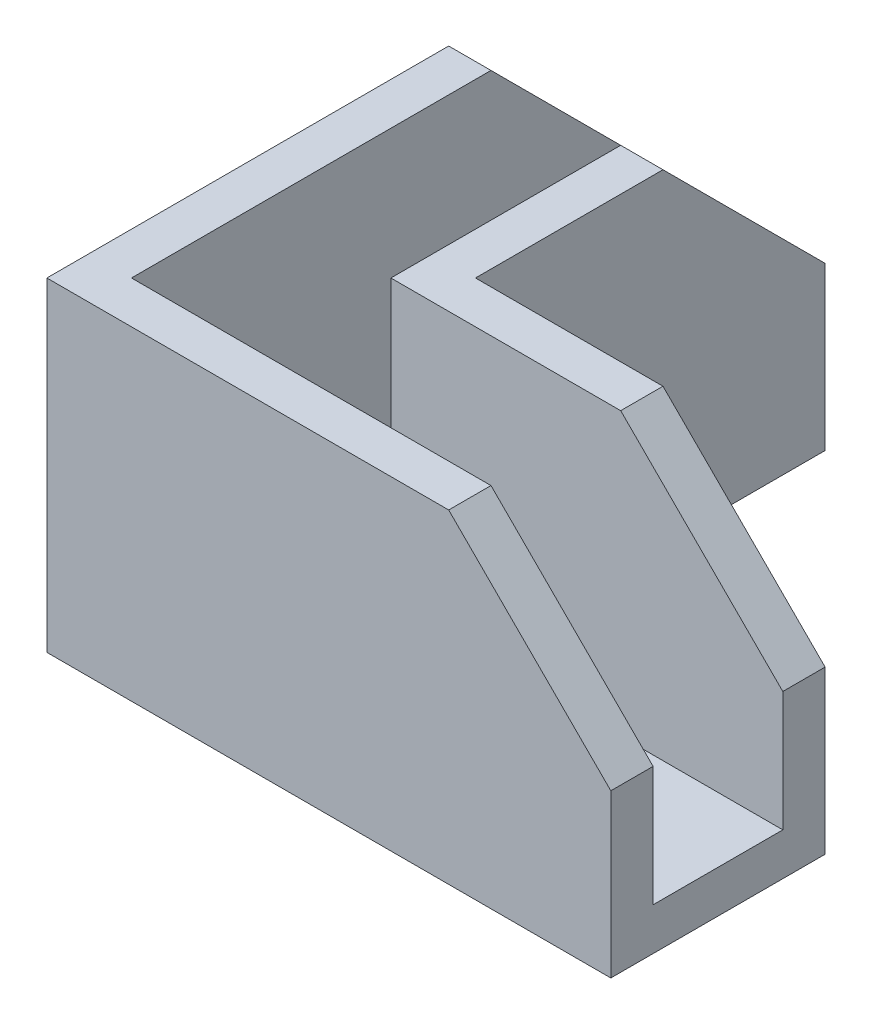
ISO-10303-21;
HEADER;
FILE_DESCRIPTION(('STEP AP214'),'2;1');
FILE_NAME('part.step','',(''),(''),'','','');
FILE_SCHEMA(('AUTOMOTIVE_DESIGN { 1 0 10303 214 1 1 1 1 }'));
ENDSEC;
DATA;
#1=APPLICATION_CONTEXT('core data for automotive mechanical design processes');
#2=APPLICATION_PROTOCOL_DEFINITION('international standard','automotive_design',2000,#1);
#3=PRODUCT_CONTEXT('',#1,'mechanical');
#4=PRODUCT('Part','Part','',(#3));
#5=PRODUCT_RELATED_PRODUCT_CATEGORY('part','',(#4));
#6=PRODUCT_DEFINITION_FORMATION('','',#4);
#7=PRODUCT_DEFINITION_CONTEXT('part definition',#1,'design');
#8=PRODUCT_DEFINITION('design','',#6,#7);
#9=PRODUCT_DEFINITION_SHAPE('','',#8);
#10=(LENGTH_UNIT() NAMED_UNIT(*) SI_UNIT(.MILLI.,.METRE.));
#11=(NAMED_UNIT(*) PLANE_ANGLE_UNIT() SI_UNIT($,.RADIAN.));
#12=(NAMED_UNIT(*) SI_UNIT($,.STERADIAN.) SOLID_ANGLE_UNIT());
#13=UNCERTAINTY_MEASURE_WITH_UNIT(LENGTH_MEASURE(1.E-05),#10,'distance_accuracy_value','');
#14=(GEOMETRIC_REPRESENTATION_CONTEXT(3) GLOBAL_UNCERTAINTY_ASSIGNED_CONTEXT((#13)) GLOBAL_UNIT_ASSIGNED_CONTEXT((#10,
#11,#12)) REPRESENTATION_CONTEXT('',''));
#15=CARTESIAN_POINT('',(0.,0.,0.));
#16=DIRECTION('',(0.,0.,1.));
#17=DIRECTION('',(1.,0.,0.));
#18=AXIS2_PLACEMENT_3D('',#15,#16,#17);
#19=CARTESIAN_POINT('',(0.,0.,0.));
#20=DIRECTION('',(0.,1.,0.));
#21=DIRECTION('',(0.,0.,1.));
#22=AXIS2_PLACEMENT_3D('',#19,#20,#21);
#23=PLANE('',#22);
#24=DIRECTION('',(1.,0.,0.));
#25=VECTOR('',#24,1.);
#26=CARTESIAN_POINT('',(0.,0.,-12.2));
#27=LINE('',#26,#25);
#28=CARTESIAN_POINT('',(12.2,0.,-12.2));
#29=VERTEX_POINT('',#28);
#30=CARTESIAN_POINT('',(40.,0.,-12.2));
#31=VERTEX_POINT('',#30);
#32=EDGE_CURVE('E285',#29,#31,#27,.T.);
#33=ORIENTED_EDGE('',*,*,#32,.F.);
#34=DIRECTION('',(0.,0.,1.));
#35=VECTOR('',#34,1.);
#36=CARTESIAN_POINT('',(12.2,0.,0.));
#37=LINE('',#36,#35);
#38=CARTESIAN_POINT('',(12.2,0.,-40.));
#39=VERTEX_POINT('',#38);
#40=EDGE_CURVE('E289',#39,#29,#37,.T.);
#41=ORIENTED_EDGE('',*,*,#40,.F.);
#42=DIRECTION('',(1.,0.,0.));
#43=VECTOR('',#42,1.);
#44=CARTESIAN_POINT('',(0.,0.,-40.));
#45=LINE('',#44,#43);
#46=CARTESIAN_POINT('',(3.,0.,-40.));
#47=VERTEX_POINT('',#46);
#48=EDGE_CURVE('E243',#47,#39,#45,.T.);
#49=ORIENTED_EDGE('',*,*,#48,.F.);
#50=DIRECTION('',(0.,0.,1.));
#51=VECTOR('',#50,1.);
#52=CARTESIAN_POINT('',(3.,0.,0.));
#53=LINE('',#52,#51);
#54=CARTESIAN_POINT('',(3.,0.,-3.));
#55=VERTEX_POINT('',#54);
#56=EDGE_CURVE('E264',#47,#55,#53,.T.);
#57=ORIENTED_EDGE('',*,*,#56,.T.);
#58=DIRECTION('',(1.,0.,0.));
#59=VECTOR('',#58,1.);
#60=CARTESIAN_POINT('',(0.,0.,-3.));
#61=LINE('',#60,#59);
#62=CARTESIAN_POINT('',(40.,0.,-3.));
#63=VERTEX_POINT('',#62);
#64=EDGE_CURVE('E268',#55,#63,#61,.T.);
#65=ORIENTED_EDGE('',*,*,#64,.T.);
#66=DIRECTION('',(0.,0.,1.));
#67=VECTOR('',#66,1.);
#68=CARTESIAN_POINT('',(40.,0.,0.));
#69=LINE('',#68,#67);
#70=EDGE_CURVE('E240',#31,#63,#69,.T.);
#71=ORIENTED_EDGE('',*,*,#70,.F.);
#72=EDGE_LOOP('',(#33,#41,#49,#57,#65,#71));
#73=FACE_BOUND('',#72,.T.);
#74=ADVANCED_FACE('F83',(#73),#23,.T.);
#75=CARTESIAN_POINT('',(0.,-3.,-40.));
#76=DIRECTION('',(0.,0.,1.));
#77=DIRECTION('',(1.,0.,0.));
#78=AXIS2_PLACEMENT_3D('',#75,#76,#77);
#79=PLANE('',#78);
#80=DIRECTION('',(0.,1.,0.));
#81=VECTOR('',#80,1.);
#82=CARTESIAN_POINT('',(0.,-3.,-40.));
#83=LINE('',#82,#81);
#84=CARTESIAN_POINT('',(0.,-3.,-40.));
#85=VERTEX_POINT('',#84);
#86=CARTESIAN_POINT('',(0.,8.5,-40.));
#87=VERTEX_POINT('',#86);
#88=EDGE_CURVE('E224',#85,#87,#83,.T.);
#89=ORIENTED_EDGE('',*,*,#88,.T.);
#90=DIRECTION('',(-1.,0.,0.));
#91=VECTOR('',#90,1.);
#92=CARTESIAN_POINT('',(40.,8.5,-40.));
#93=LINE('',#92,#91);
#94=CARTESIAN_POINT('',(3.,8.5,-40.));
#95=VERTEX_POINT('',#94);
#96=EDGE_CURVE('E308',#95,#87,#93,.T.);
#97=ORIENTED_EDGE('',*,*,#96,.F.);
#98=DIRECTION('',(0.,-1.,0.));
#99=VECTOR('',#98,1.);
#100=CARTESIAN_POINT('',(3.,20.,-40.));
#101=LINE('',#100,#99);
#102=EDGE_CURVE('E260',#95,#47,#101,.T.);
#103=ORIENTED_EDGE('',*,*,#102,.T.);
#104=ORIENTED_EDGE('',*,*,#48,.T.);
#105=DIRECTION('',(0.,-1.,0.));
#106=VECTOR('',#105,1.);
#107=CARTESIAN_POINT('',(12.2,20.,-40.));
#108=LINE('',#107,#106);
#109=CARTESIAN_POINT('',(12.2,8.5,-40.));
#110=VERTEX_POINT('',#109);
#111=EDGE_CURVE('E282',#110,#39,#108,.T.);
#112=ORIENTED_EDGE('',*,*,#111,.F.);
#113=CARTESIAN_POINT('',(15.2,8.5,-40.));
#114=VERTEX_POINT('',#113);
#115=EDGE_CURVE('E310',#114,#110,#93,.T.);
#116=ORIENTED_EDGE('',*,*,#115,.F.);
#117=DIRECTION('',(0.,1.,0.));
#118=VECTOR('',#117,1.);
#119=CARTESIAN_POINT('',(15.2,-3.,-40.));
#120=LINE('',#119,#118);
#121=CARTESIAN_POINT('',(15.2,-3.,-40.));
#122=VERTEX_POINT('',#121);
#123=EDGE_CURVE('E230',#122,#114,#120,.T.);
#124=ORIENTED_EDGE('',*,*,#123,.F.);
#125=DIRECTION('',(1.,0.,0.));
#126=VECTOR('',#125,1.);
#127=CARTESIAN_POINT('',(0.,-3.,-40.));
#128=LINE('',#127,#126);
#129=EDGE_CURVE('E242',#85,#122,#128,.T.);
#130=ORIENTED_EDGE('',*,*,#129,.F.);
#131=EDGE_LOOP('',(#89,#97,#103,#104,#112,#116,#124,#130));
#132=FACE_BOUND('',#131,.T.);
#133=ADVANCED_FACE('F85',(#132),#79,.F.);
#134=CARTESIAN_POINT('',(15.2,-3.,0.));
#135=DIRECTION('',(-1.,0.,0.));
#136=DIRECTION('',(0.,0.,1.));
#137=AXIS2_PLACEMENT_3D('',#134,#135,#136);
#138=PLANE('',#137);
#139=ORIENTED_EDGE('',*,*,#123,.T.);
#140=DIRECTION('',(0.,0.707106781186546,0.707106781186549));
#141=VECTOR('',#140,1.);
#142=CARTESIAN_POINT('',(15.2,22.75,-25.7499999999999));
#143=LINE('',#142,#141);
#144=CARTESIAN_POINT('',(15.2,20.,-28.5));
#145=VERTEX_POINT('',#144);
#146=EDGE_CURVE('E292',#114,#145,#143,.T.);
#147=ORIENTED_EDGE('',*,*,#146,.T.);
#148=DIRECTION('',(0.,0.,1.));
#149=VECTOR('',#148,1.);
#150=CARTESIAN_POINT('',(15.2,20.,0.));
#151=LINE('',#150,#149);
#152=CARTESIAN_POINT('',(15.2,20.,-15.2));
#153=VERTEX_POINT('',#152);
#154=EDGE_CURVE('E284',#145,#153,#151,.T.);
#155=ORIENTED_EDGE('',*,*,#154,.T.);
#156=DIRECTION('',(0.,1.,0.));
#157=VECTOR('',#156,1.);
#158=CARTESIAN_POINT('',(15.2,-3.,-15.2));
#159=LINE('',#158,#157);
#160=CARTESIAN_POINT('',(15.2,-3.,-15.2));
#161=VERTEX_POINT('',#160);
#162=EDGE_CURVE('E221',#161,#153,#159,.T.);
#163=ORIENTED_EDGE('',*,*,#162,.F.);
#164=DIRECTION('',(0.,0.,1.));
#165=VECTOR('',#164,1.);
#166=CARTESIAN_POINT('',(15.2,-3.,0.));
#167=LINE('',#166,#165);
#168=EDGE_CURVE('E229',#122,#161,#167,.T.);
#169=ORIENTED_EDGE('',*,*,#168,.F.);
#170=EDGE_LOOP('',(#139,#147,#155,#163,#169));
#171=FACE_BOUND('',#170,.T.);
#172=ADVANCED_FACE('F370',(#171),#138,.F.);
#173=CARTESIAN_POINT('',(0.,-3.,-15.2));
#174=DIRECTION('',(0.,0.,1.));
#175=DIRECTION('',(1.,0.,0.));
#176=AXIS2_PLACEMENT_3D('',#173,#174,#175);
#177=PLANE('',#176);
#178=DIRECTION('',(1.,0.,0.));
#179=VECTOR('',#178,1.);
#180=CARTESIAN_POINT('',(0.,20.,-15.2));
#181=LINE('',#180,#179);
#182=CARTESIAN_POINT('',(28.5,20.,-15.2));
#183=VERTEX_POINT('',#182);
#184=EDGE_CURVE('E294',#153,#183,#181,.T.);
#185=ORIENTED_EDGE('',*,*,#184,.T.);
#186=DIRECTION('',(-0.707106781186546,0.707106781186549,0.));
#187=VECTOR('',#186,1.);
#188=CARTESIAN_POINT('',(40.,8.5,-15.2));
#189=LINE('',#188,#187);
#190=CARTESIAN_POINT('',(40.,8.5,-15.2));
#191=VERTEX_POINT('',#190);
#192=EDGE_CURVE('E105',#191,#183,#189,.T.);
#193=ORIENTED_EDGE('',*,*,#192,.F.);
#194=DIRECTION('',(0.,1.,0.));
#195=VECTOR('',#194,1.);
#196=CARTESIAN_POINT('',(40.,-3.,-15.2));
#197=LINE('',#196,#195);
#198=CARTESIAN_POINT('',(40.,-3.,-15.2));
#199=VERTEX_POINT('',#198);
#200=EDGE_CURVE('E218',#199,#191,#197,.T.);
#201=ORIENTED_EDGE('',*,*,#200,.F.);
#202=DIRECTION('',(1.,0.,0.));
#203=VECTOR('',#202,1.);
#204=CARTESIAN_POINT('',(0.,-3.,-15.2));
#205=LINE('',#204,#203);
#206=EDGE_CURVE('E248',#161,#199,#205,.T.);
#207=ORIENTED_EDGE('',*,*,#206,.F.);
#208=ORIENTED_EDGE('',*,*,#162,.T.);
#209=EDGE_LOOP('',(#185,#193,#201,#207,#208));
#210=FACE_BOUND('',#209,.T.);
#211=ADVANCED_FACE('F354',(#210),#177,.F.);
#212=CARTESIAN_POINT('',(40.,-3.,0.));
#213=DIRECTION('',(-1.,0.,0.));
#214=DIRECTION('',(0.,0.,1.));
#215=AXIS2_PLACEMENT_3D('',#212,#213,#214);
#216=PLANE('',#215);
#217=ORIENTED_EDGE('',*,*,#200,.T.);
#218=DIRECTION('',(0.,0.,-1.));
#219=VECTOR('',#218,1.);
#220=CARTESIAN_POINT('',(40.,8.5,0.));
#221=LINE('',#220,#219);
#222=CARTESIAN_POINT('',(40.,8.5,-12.2));
#223=VERTEX_POINT('',#222);
#224=EDGE_CURVE('E202',#223,#191,#221,.T.);
#225=ORIENTED_EDGE('',*,*,#224,.F.);
#226=DIRECTION('',(0.,-1.,0.));
#227=VECTOR('',#226,1.);
#228=CARTESIAN_POINT('',(40.,20.,-12.2));
#229=LINE('',#228,#227);
#230=EDGE_CURVE('E280',#223,#31,#229,.T.);
#231=ORIENTED_EDGE('',*,*,#230,.T.);
#232=ORIENTED_EDGE('',*,*,#70,.T.);
#233=DIRECTION('',(0.,-1.,0.));
#234=VECTOR('',#233,1.);
#235=CARTESIAN_POINT('',(40.,20.,-3.));
#236=LINE('',#235,#234);
#237=CARTESIAN_POINT('',(40.,8.5,-3.));
#238=VERTEX_POINT('',#237);
#239=EDGE_CURVE('E213',#238,#63,#236,.T.);
#240=ORIENTED_EDGE('',*,*,#239,.F.);
#241=CARTESIAN_POINT('',(40.,8.5,0.));
#242=VERTEX_POINT('',#241);
#243=EDGE_CURVE('E196',#242,#238,#221,.T.);
#244=ORIENTED_EDGE('',*,*,#243,.F.);
#245=DIRECTION('',(0.,1.,0.));
#246=VECTOR('',#245,1.);
#247=CARTESIAN_POINT('',(40.,-3.,0.));
#248=LINE('',#247,#246);
#249=CARTESIAN_POINT('',(40.,-3.,0.));
#250=VERTEX_POINT('',#249);
#251=EDGE_CURVE('E210',#250,#242,#248,.T.);
#252=ORIENTED_EDGE('',*,*,#251,.F.);
#253=DIRECTION('',(0.,0.,1.));
#254=VECTOR('',#253,1.);
#255=CARTESIAN_POINT('',(40.,-3.,0.));
#256=LINE('',#255,#254);
#257=EDGE_CURVE('E250',#199,#250,#256,.T.);
#258=ORIENTED_EDGE('',*,*,#257,.F.);
#259=EDGE_LOOP('',(#217,#225,#231,#232,#240,#244,#252,#258));
#260=FACE_BOUND('',#259,.T.);
#261=ADVANCED_FACE('F208',(#260),#216,.F.);
#262=CARTESIAN_POINT('',(0.,-3.,0.));
#263=DIRECTION('',(0.,0.,1.));
#264=DIRECTION('',(1.,0.,0.));
#265=AXIS2_PLACEMENT_3D('',#262,#263,#264);
#266=PLANE('',#265);
#267=DIRECTION('',(-0.707106781186546,0.707106781186549,0.));
#268=VECTOR('',#267,1.);
#269=CARTESIAN_POINT('',(40.,8.5,0.));
#270=LINE('',#269,#268);
#271=CARTESIAN_POINT('',(28.5,20.,0.));
#272=VERTEX_POINT('',#271);
#273=EDGE_CURVE('E193',#242,#272,#270,.T.);
#274=ORIENTED_EDGE('',*,*,#273,.T.);
#275=DIRECTION('',(1.,0.,0.));
#276=VECTOR('',#275,1.);
#277=CARTESIAN_POINT('',(0.,20.,0.));
#278=LINE('',#277,#276);
#279=CARTESIAN_POINT('',(0.,20.,0.));
#280=VERTEX_POINT('',#279);
#281=EDGE_CURVE('E263',#280,#272,#278,.T.);
#282=ORIENTED_EDGE('',*,*,#281,.F.);
#283=DIRECTION('',(0.,1.,0.));
#284=VECTOR('',#283,1.);
#285=CARTESIAN_POINT('',(0.,-3.,0.));
#286=LINE('',#285,#284);
#287=CARTESIAN_POINT('',(0.,-3.,0.));
#288=VERTEX_POINT('',#287);
#289=EDGE_CURVE('E219',#288,#280,#286,.T.);
#290=ORIENTED_EDGE('',*,*,#289,.F.);
#291=DIRECTION('',(1.,0.,0.));
#292=VECTOR('',#291,1.);
#293=CARTESIAN_POINT('',(0.,-3.,0.));
#294=LINE('',#293,#292);
#295=EDGE_CURVE('E217',#288,#250,#294,.T.);
#296=ORIENTED_EDGE('',*,*,#295,.T.);
#297=ORIENTED_EDGE('',*,*,#251,.T.);
#298=EDGE_LOOP('',(#274,#282,#290,#296,#297));
#299=FACE_BOUND('',#298,.T.);
#300=ADVANCED_FACE('F215',(#299),#266,.T.);
#301=CARTESIAN_POINT('',(0.,-3.,0.));
#302=DIRECTION('',(-1.,0.,0.));
#303=DIRECTION('',(0.,0.,1.));
#304=AXIS2_PLACEMENT_3D('',#301,#302,#303);
#305=PLANE('',#304);
#306=DIRECTION('',(0.,0.707106781186546,0.707106781186549));
#307=VECTOR('',#306,1.);
#308=CARTESIAN_POINT('',(0.,8.5,-40.));
#309=LINE('',#308,#307);
#310=CARTESIAN_POINT('',(0.,20.,-28.5));
#311=VERTEX_POINT('',#310);
#312=EDGE_CURVE('E311',#87,#311,#309,.T.);
#313=ORIENTED_EDGE('',*,*,#312,.F.);
#314=ORIENTED_EDGE('',*,*,#88,.F.);
#315=DIRECTION('',(0.,0.,1.));
#316=VECTOR('',#315,1.);
#317=CARTESIAN_POINT('',(0.,-3.,0.));
#318=LINE('',#317,#316);
#319=EDGE_CURVE('E253',#85,#288,#318,.T.);
#320=ORIENTED_EDGE('',*,*,#319,.T.);
#321=ORIENTED_EDGE('',*,*,#289,.T.);
#322=DIRECTION('',(0.,0.,1.));
#323=VECTOR('',#322,1.);
#324=CARTESIAN_POINT('',(0.,20.,0.));
#325=LINE('',#324,#323);
#326=EDGE_CURVE('E273',#311,#280,#325,.T.);
#327=ORIENTED_EDGE('',*,*,#326,.F.);
#328=EDGE_LOOP('',(#313,#314,#320,#321,#327));
#329=FACE_BOUND('',#328,.T.);
#330=ADVANCED_FACE('F345',(#329),#305,.T.);
#331=CARTESIAN_POINT('',(0.,-3.,0.));
#332=DIRECTION('',(0.,1.,0.));
#333=DIRECTION('',(0.,0.,1.));
#334=AXIS2_PLACEMENT_3D('',#331,#332,#333);
#335=PLANE('',#334);
#336=ORIENTED_EDGE('',*,*,#129,.T.);
#337=ORIENTED_EDGE('',*,*,#168,.T.);
#338=ORIENTED_EDGE('',*,*,#206,.T.);
#339=ORIENTED_EDGE('',*,*,#257,.T.);
#340=ORIENTED_EDGE('',*,*,#295,.F.);
#341=ORIENTED_EDGE('',*,*,#319,.F.);
#342=EDGE_LOOP('',(#336,#337,#338,#339,#340,#341));
#343=FACE_BOUND('',#342,.T.);
#344=ADVANCED_FACE('F348',(#343),#335,.F.);
#345=CARTESIAN_POINT('',(0.,20.,-3.));
#346=DIRECTION('',(0.,0.,-1.));
#347=DIRECTION('',(-1.,0.,0.));
#348=AXIS2_PLACEMENT_3D('',#345,#346,#347);
#349=PLANE('',#348);
#350=DIRECTION('',(-0.707106781186546,0.707106781186549,0.));
#351=VECTOR('',#350,1.);
#352=CARTESIAN_POINT('',(14.2500000000001,34.25,-3.));
#353=LINE('',#352,#351);
#354=CARTESIAN_POINT('',(28.5,20.,-3.));
#355=VERTEX_POINT('',#354);
#356=EDGE_CURVE('E98',#238,#355,#353,.T.);
#357=ORIENTED_EDGE('',*,*,#356,.F.);
#358=ORIENTED_EDGE('',*,*,#239,.T.);
#359=ORIENTED_EDGE('',*,*,#64,.F.);
#360=DIRECTION('',(0.,-1.,0.));
#361=VECTOR('',#360,1.);
#362=CARTESIAN_POINT('',(3.,20.,-3.));
#363=LINE('',#362,#361);
#364=CARTESIAN_POINT('',(3.,20.,-3.));
#365=VERTEX_POINT('',#364);
#366=EDGE_CURVE('E246',#365,#55,#363,.T.);
#367=ORIENTED_EDGE('',*,*,#366,.F.);
#368=DIRECTION('',(1.,0.,0.));
#369=VECTOR('',#368,1.);
#370=CARTESIAN_POINT('',(0.,20.,-3.));
#371=LINE('',#370,#369);
#372=EDGE_CURVE('E267',#365,#355,#371,.T.);
#373=ORIENTED_EDGE('',*,*,#372,.T.);
#374=EDGE_LOOP('',(#357,#358,#359,#367,#373));
#375=FACE_BOUND('',#374,.T.);
#376=ADVANCED_FACE('F326',(#375),#349,.T.);
#377=CARTESIAN_POINT('',(3.,20.,0.));
#378=DIRECTION('',(1.,0.,0.));
#379=DIRECTION('',(0.,0.,-1.));
#380=AXIS2_PLACEMENT_3D('',#377,#378,#379);
#381=PLANE('',#380);
#382=DIRECTION('',(0.,-0.707106781186546,-0.707106781186549));
#383=VECTOR('',#382,1.);
#384=CARTESIAN_POINT('',(3.,34.25,-14.2499999999999));
#385=LINE('',#384,#383);
#386=CARTESIAN_POINT('',(3.,20.,-28.5));
#387=VERTEX_POINT('',#386);
#388=EDGE_CURVE('E302',#387,#95,#385,.T.);
#389=ORIENTED_EDGE('',*,*,#388,.F.);
#390=DIRECTION('',(0.,0.,1.));
#391=VECTOR('',#390,1.);
#392=CARTESIAN_POINT('',(3.,20.,0.));
#393=LINE('',#392,#391);
#394=EDGE_CURVE('E275',#387,#365,#393,.T.);
#395=ORIENTED_EDGE('',*,*,#394,.T.);
#396=ORIENTED_EDGE('',*,*,#366,.T.);
#397=ORIENTED_EDGE('',*,*,#56,.F.);
#398=ORIENTED_EDGE('',*,*,#102,.F.);
#399=EDGE_LOOP('',(#389,#395,#396,#397,#398));
#400=FACE_BOUND('',#399,.T.);
#401=ADVANCED_FACE('F330',(#400),#381,.T.);
#402=CARTESIAN_POINT('',(0.,20.,0.));
#403=DIRECTION('',(0.,1.,0.));
#404=DIRECTION('',(0.,0.,1.));
#405=AXIS2_PLACEMENT_3D('',#402,#403,#404);
#406=PLANE('',#405);
#407=DIRECTION('',(0.,0.,-1.));
#408=VECTOR('',#407,1.);
#409=CARTESIAN_POINT('',(28.5,20.,0.));
#410=LINE('',#409,#408);
#411=EDGE_CURVE('E197',#272,#355,#410,.T.);
#412=ORIENTED_EDGE('',*,*,#411,.T.);
#413=ORIENTED_EDGE('',*,*,#372,.F.);
#414=ORIENTED_EDGE('',*,*,#394,.F.);
#415=DIRECTION('',(-1.,0.,0.));
#416=VECTOR('',#415,1.);
#417=CARTESIAN_POINT('',(40.,20.,-28.5));
#418=LINE('',#417,#416);
#419=EDGE_CURVE('E307',#387,#311,#418,.T.);
#420=ORIENTED_EDGE('',*,*,#419,.T.);
#421=ORIENTED_EDGE('',*,*,#326,.T.);
#422=ORIENTED_EDGE('',*,*,#281,.T.);
#423=EDGE_LOOP('',(#412,#413,#414,#420,#421,#422));
#424=FACE_BOUND('',#423,.T.);
#425=ADVANCED_FACE('F322',(#424),#406,.T.);
#426=CARTESIAN_POINT('',(12.2,20.,0.));
#427=DIRECTION('',(1.,0.,0.));
#428=DIRECTION('',(0.,0.,-1.));
#429=AXIS2_PLACEMENT_3D('',#426,#427,#428);
#430=PLANE('',#429);
#431=DIRECTION('',(0.,0.,1.));
#432=VECTOR('',#431,1.);
#433=CARTESIAN_POINT('',(12.2,20.,0.));
#434=LINE('',#433,#432);
#435=CARTESIAN_POINT('',(12.2,20.,-28.5));
#436=VERTEX_POINT('',#435);
#437=CARTESIAN_POINT('',(12.2,20.,-12.2));
#438=VERTEX_POINT('',#437);
#439=EDGE_CURVE('E288',#436,#438,#434,.T.);
#440=ORIENTED_EDGE('',*,*,#439,.F.);
#441=DIRECTION('',(0.,-0.707106781186546,-0.707106781186549));
#442=VECTOR('',#441,1.);
#443=CARTESIAN_POINT('',(12.2,34.25,-14.2499999999999));
#444=LINE('',#443,#442);
#445=EDGE_CURVE('E304',#436,#110,#444,.T.);
#446=ORIENTED_EDGE('',*,*,#445,.T.);
#447=ORIENTED_EDGE('',*,*,#111,.T.);
#448=ORIENTED_EDGE('',*,*,#40,.T.);
#449=DIRECTION('',(0.,-1.,0.));
#450=VECTOR('',#449,1.);
#451=CARTESIAN_POINT('',(12.2,20.,-12.2));
#452=LINE('',#451,#450);
#453=EDGE_CURVE('E271',#438,#29,#452,.T.);
#454=ORIENTED_EDGE('',*,*,#453,.F.);
#455=EDGE_LOOP('',(#440,#446,#447,#448,#454));
#456=FACE_BOUND('',#455,.T.);
#457=ADVANCED_FACE('F367',(#456),#430,.F.);
#458=CARTESIAN_POINT('',(0.,20.,-12.2));
#459=DIRECTION('',(0.,0.,-1.));
#460=DIRECTION('',(-1.,0.,0.));
#461=AXIS2_PLACEMENT_3D('',#458,#459,#460);
#462=PLANE('',#461);
#463=ORIENTED_EDGE('',*,*,#230,.F.);
#464=DIRECTION('',(-0.707106781186546,0.707106781186549,0.));
#465=VECTOR('',#464,1.);
#466=CARTESIAN_POINT('',(14.2500000000001,34.25,-12.2));
#467=LINE('',#466,#465);
#468=CARTESIAN_POINT('',(28.5,20.,-12.2));
#469=VERTEX_POINT('',#468);
#470=EDGE_CURVE('E316',#223,#469,#467,.T.);
#471=ORIENTED_EDGE('',*,*,#470,.T.);
#472=DIRECTION('',(1.,0.,0.));
#473=VECTOR('',#472,1.);
#474=CARTESIAN_POINT('',(0.,20.,-12.2));
#475=LINE('',#474,#473);
#476=EDGE_CURVE('E297',#438,#469,#475,.T.);
#477=ORIENTED_EDGE('',*,*,#476,.F.);
#478=ORIENTED_EDGE('',*,*,#453,.T.);
#479=ORIENTED_EDGE('',*,*,#32,.T.);
#480=EDGE_LOOP('',(#463,#471,#477,#478,#479));
#481=FACE_BOUND('',#480,.T.);
#482=ADVANCED_FACE('F363',(#481),#462,.F.);
#483=CARTESIAN_POINT('',(0.,20.,0.));
#484=DIRECTION('',(0.,1.,0.));
#485=DIRECTION('',(0.,0.,1.));
#486=AXIS2_PLACEMENT_3D('',#483,#484,#485);
#487=PLANE('',#486);
#488=DIRECTION('',(0.,0.,1.));
#489=VECTOR('',#488,1.);
#490=CARTESIAN_POINT('',(28.5,20.,0.));
#491=LINE('',#490,#489);
#492=EDGE_CURVE('E12',#183,#469,#491,.T.);
#493=ORIENTED_EDGE('',*,*,#492,.F.);
#494=ORIENTED_EDGE('',*,*,#184,.F.);
#495=ORIENTED_EDGE('',*,*,#154,.F.);
#496=DIRECTION('',(1.,0.,0.));
#497=VECTOR('',#496,1.);
#498=CARTESIAN_POINT('',(0.,20.,-28.5));
#499=LINE('',#498,#497);
#500=EDGE_CURVE('E91',#436,#145,#499,.T.);
#501=ORIENTED_EDGE('',*,*,#500,.F.);
#502=ORIENTED_EDGE('',*,*,#439,.T.);
#503=ORIENTED_EDGE('',*,*,#476,.T.);
#504=EDGE_LOOP('',(#493,#494,#495,#501,#502,#503));
#505=FACE_BOUND('',#504,.T.);
#506=ADVANCED_FACE('F359',(#505),#487,.T.);
#507=CARTESIAN_POINT('',(40.,8.5,-40.));
#508=DIRECTION('',(0.,-0.707106781186549,0.707106781186546));
#509=DIRECTION('',(0.,-0.707106781186546,-0.707106781186549));
#510=AXIS2_PLACEMENT_3D('',#507,#508,#509);
#511=PLANE('',#510);
#512=ORIENTED_EDGE('',*,*,#115,.T.);
#513=ORIENTED_EDGE('',*,*,#445,.F.);
#514=ORIENTED_EDGE('',*,*,#500,.T.);
#515=ORIENTED_EDGE('',*,*,#146,.F.);
#516=EDGE_LOOP('',(#512,#513,#514,#515));
#517=FACE_BOUND('',#516,.T.);
#518=ADVANCED_FACE('F368',(#517),#511,.F.);
#519=ORIENTED_EDGE('',*,*,#388,.T.);
#520=ORIENTED_EDGE('',*,*,#96,.T.);
#521=ORIENTED_EDGE('',*,*,#312,.T.);
#522=ORIENTED_EDGE('',*,*,#419,.F.);
#523=EDGE_LOOP('',(#519,#520,#521,#522));
#524=FACE_BOUND('',#523,.T.);
#525=ADVANCED_FACE('F398',(#524),#511,.F.);
#526=CARTESIAN_POINT('',(40.,8.5,0.));
#527=DIRECTION('',(-0.707106781186549,-0.707106781186546,0.));
#528=DIRECTION('',(0.707106781186546,-0.707106781186549,0.));
#529=AXIS2_PLACEMENT_3D('',#526,#527,#528);
#530=PLANE('',#529);
#531=ORIENTED_EDGE('',*,*,#224,.T.);
#532=ORIENTED_EDGE('',*,*,#192,.T.);
#533=ORIENTED_EDGE('',*,*,#492,.T.);
#534=ORIENTED_EDGE('',*,*,#470,.F.);
#535=EDGE_LOOP('',(#531,#532,#533,#534));
#536=FACE_BOUND('',#535,.T.);
#537=ADVANCED_FACE('F361',(#536),#530,.F.);
#538=ORIENTED_EDGE('',*,*,#356,.T.);
#539=ORIENTED_EDGE('',*,*,#411,.F.);
#540=ORIENTED_EDGE('',*,*,#273,.F.);
#541=ORIENTED_EDGE('',*,*,#243,.T.);
#542=EDGE_LOOP('',(#538,#539,#540,#541));
#543=FACE_BOUND('',#542,.T.);
#544=ADVANCED_FACE('F195',(#543),#530,.F.);
#545=CLOSED_SHELL('',(#74,#133,#172,#211,#261,#300,#330,#344,#376,#401,#425,#457,#482,#506,#518,
#525,#537,#544));
#546=MANIFOLD_SOLID_BREP('B2',#545);
#547=ADVANCED_BREP_SHAPE_REPRESENTATION('',(#18,#546),#14);
#548=SHAPE_DEFINITION_REPRESENTATION(#9,#547);
ENDSEC;
END-ISO-10303-21;
